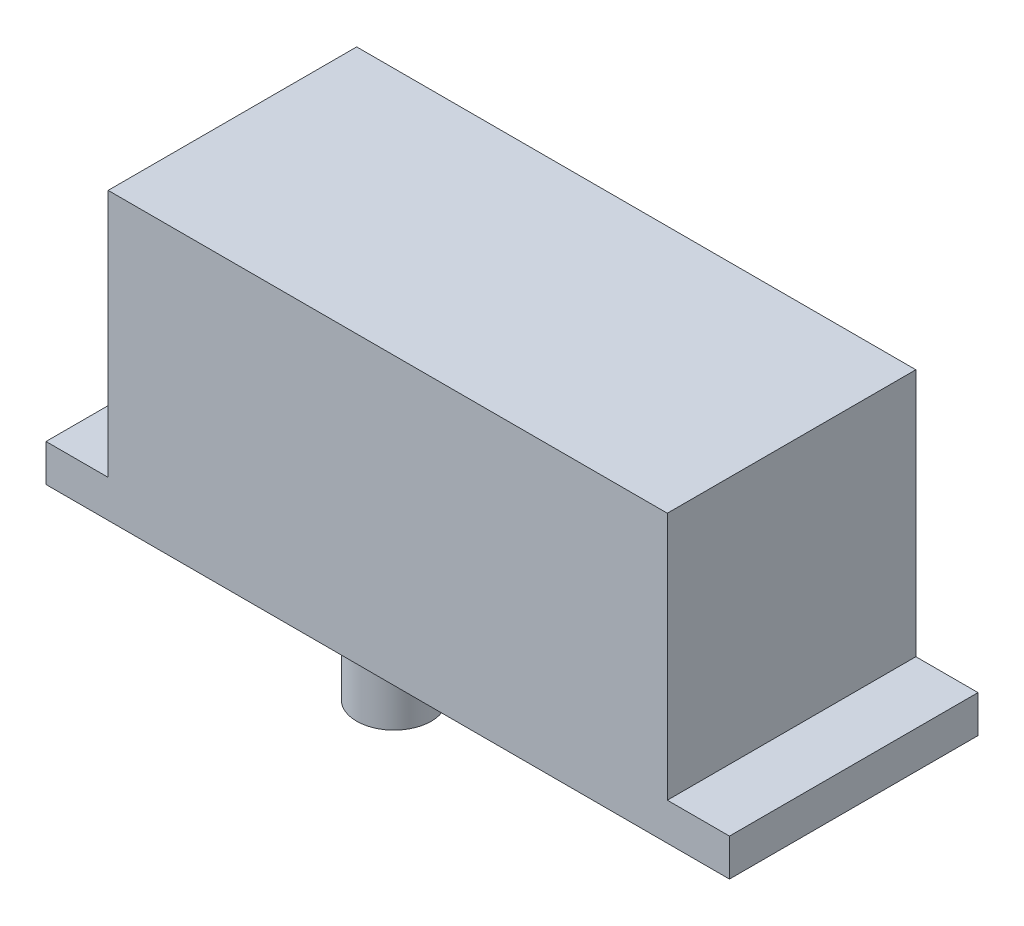
ISO-10303-21;
HEADER;
FILE_DESCRIPTION(('STEP AP214'),'2;1');
FILE_NAME('part.step','',(''),(''),'','','');
FILE_SCHEMA(('AUTOMOTIVE_DESIGN { 1 0 10303 214 1 1 1 1 }'));
ENDSEC;
DATA;
#1=APPLICATION_CONTEXT('core data for automotive mechanical design processes');
#2=APPLICATION_PROTOCOL_DEFINITION('international standard','automotive_design',2000,#1);
#3=PRODUCT_CONTEXT('',#1,'mechanical');
#4=PRODUCT('Part','Part','',(#3));
#5=PRODUCT_RELATED_PRODUCT_CATEGORY('part','',(#4));
#6=PRODUCT_DEFINITION_FORMATION('','',#4);
#7=PRODUCT_DEFINITION_CONTEXT('part definition',#1,'design');
#8=PRODUCT_DEFINITION('design','',#6,#7);
#9=PRODUCT_DEFINITION_SHAPE('','',#8);
#10=(LENGTH_UNIT() NAMED_UNIT(*) SI_UNIT(.MILLI.,.METRE.));
#11=(NAMED_UNIT(*) PLANE_ANGLE_UNIT() SI_UNIT($,.RADIAN.));
#12=(NAMED_UNIT(*) SI_UNIT($,.STERADIAN.) SOLID_ANGLE_UNIT());
#13=UNCERTAINTY_MEASURE_WITH_UNIT(LENGTH_MEASURE(1.E-05),#10,'distance_accuracy_value','');
#14=(GEOMETRIC_REPRESENTATION_CONTEXT(3) GLOBAL_UNCERTAINTY_ASSIGNED_CONTEXT((#13)) GLOBAL_UNIT_ASSIGNED_CONTEXT((#10,
#11,#12)) REPRESENTATION_CONTEXT('',''));
#15=CARTESIAN_POINT('',(0.,0.,0.));
#16=DIRECTION('',(0.,0.,1.));
#17=DIRECTION('',(1.,0.,0.));
#18=AXIS2_PLACEMENT_3D('',#15,#16,#17);
#19=CARTESIAN_POINT('',(-30.5,-13.,274.));
#20=DIRECTION('',(0.,1.,0.));
#21=DIRECTION('',(-1.,0.,0.));
#22=AXIS2_PLACEMENT_3D('',#19,#20,#21);
#23=PLANE('',#22);
#24=DIRECTION('',(1.,0.,0.));
#25=VECTOR('',#24,1.);
#26=CARTESIAN_POINT('',(-30.5,-13.,254.));
#27=LINE('',#26,#25);
#28=CARTESIAN_POINT('',(-30.5,-13.,254.));
#29=VERTEX_POINT('',#28);
#30=CARTESIAN_POINT('',(-25.5,-13.,254.));
#31=VERTEX_POINT('',#30);
#32=EDGE_CURVE('E156',#29,#31,#27,.T.);
#33=ORIENTED_EDGE('',*,*,#32,.T.);
#34=DIRECTION('',(0.,0.,-1.));
#35=VECTOR('',#34,1.);
#36=CARTESIAN_POINT('',(-25.5,-13.,274.));
#37=LINE('',#36,#35);
#38=CARTESIAN_POINT('',(-25.5,-13.,274.));
#39=VERTEX_POINT('',#38);
#40=EDGE_CURVE('E134',#39,#31,#37,.T.);
#41=ORIENTED_EDGE('',*,*,#40,.F.);
#42=DIRECTION('',(1.,0.,0.));
#43=VECTOR('',#42,1.);
#44=CARTESIAN_POINT('',(-30.5,-13.,274.));
#45=LINE('',#44,#43);
#46=CARTESIAN_POINT('',(-30.5,-13.,274.));
#47=VERTEX_POINT('',#46);
#48=EDGE_CURVE('E144',#47,#39,#45,.T.);
#49=ORIENTED_EDGE('',*,*,#48,.F.);
#50=DIRECTION('',(0.,0.,-1.));
#51=VECTOR('',#50,1.);
#52=CARTESIAN_POINT('',(-30.5,-13.,274.));
#53=LINE('',#52,#51);
#54=EDGE_CURVE('E197',#47,#29,#53,.T.);
#55=ORIENTED_EDGE('',*,*,#54,.T.);
#56=EDGE_LOOP('',(#33,#41,#49,#55));
#57=FACE_BOUND('',#56,.T.);
#58=ADVANCED_FACE('F41',(#57),#23,.F.);
#59=CARTESIAN_POINT('',(-25.5,-13.,274.));
#60=DIRECTION('',(0.707106781186548,0.707106781186547,0.));
#61=DIRECTION('',(-0.707106781186547,0.707106781186548,0.));
#62=AXIS2_PLACEMENT_3D('',#59,#60,#61);
#63=PLANE('',#62);
#64=ORIENTED_EDGE('',*,*,#40,.T.);
#65=DIRECTION('',(0.577350269189625,-0.577350269189626,0.577350269189626));
#66=VECTOR('',#65,1.);
#67=CARTESIAN_POINT('',(-20.5,-18.,259.));
#68=LINE('',#67,#66);
#69=CARTESIAN_POINT('',(-20.5,-18.,259.));
#70=VERTEX_POINT('',#69);
#71=EDGE_CURVE('E56',#31,#70,#68,.T.);
#72=ORIENTED_EDGE('',*,*,#71,.T.);
#73=DIRECTION('',(0.,0.,-1.));
#74=VECTOR('',#73,1.);
#75=CARTESIAN_POINT('',(-20.5,-18.,274.));
#76=LINE('',#75,#74);
#77=CARTESIAN_POINT('',(-20.5,-18.,269.));
#78=VERTEX_POINT('',#77);
#79=EDGE_CURVE('E136',#78,#70,#76,.T.);
#80=ORIENTED_EDGE('',*,*,#79,.F.);
#81=DIRECTION('',(0.577350269189625,-0.577350269189626,-0.577350269189626));
#82=VECTOR('',#81,1.);
#83=CARTESIAN_POINT('',(-17.,-21.5,265.5));
#84=LINE('',#83,#82);
#85=EDGE_CURVE('E130',#78,#39,#84,.F.);
#86=ORIENTED_EDGE('',*,*,#85,.T.);
#87=EDGE_LOOP('',(#64,#72,#80,#86));
#88=FACE_BOUND('',#87,.T.);
#89=ADVANCED_FACE('F132',(#88),#63,.F.);
#90=CARTESIAN_POINT('',(-20.5,-18.,274.));
#91=DIRECTION('',(0.,1.,0.));
#92=DIRECTION('',(0.,0.,1.));
#93=AXIS2_PLACEMENT_3D('',#90,#91,#92);
#94=PLANE('',#93);
#95=CARTESIAN_POINT('',(-12.5,-18.,264.));
#96=DIRECTION('',(0.,1.,0.));
#97=DIRECTION('',(0.,0.,1.));
#98=AXIS2_PLACEMENT_3D('',#95,#96,#97);
#99=CIRCLE('',#98,3.);
#100=CARTESIAN_POINT('',(-12.5,-18.,267.));
#101=VERTEX_POINT('',#100);
#102=EDGE_CURVE('E11',#101,#101,#99,.F.);
#103=ORIENTED_EDGE('',*,*,#102,.F.);
#104=EDGE_LOOP('',(#103));
#105=FACE_BOUND('',#104,.T.);
#106=ORIENTED_EDGE('',*,*,#79,.T.);
#107=DIRECTION('',(1.,0.,0.));
#108=VECTOR('',#107,1.);
#109=CARTESIAN_POINT('',(14.5,-18.,259.));
#110=LINE('',#109,#108);
#111=CARTESIAN_POINT('',(14.5,-18.,259.));
#112=VERTEX_POINT('',#111);
#113=EDGE_CURVE('E165',#70,#112,#110,.T.);
#114=ORIENTED_EDGE('',*,*,#113,.T.);
#115=DIRECTION('',(0.,0.,-1.));
#116=VECTOR('',#115,1.);
#117=CARTESIAN_POINT('',(14.5,-18.,274.));
#118=LINE('',#117,#116);
#119=CARTESIAN_POINT('',(14.5,-18.,269.));
#120=VERTEX_POINT('',#119);
#121=EDGE_CURVE('E170',#120,#112,#118,.T.);
#122=ORIENTED_EDGE('',*,*,#121,.F.);
#123=DIRECTION('',(-1.,0.,0.));
#124=VECTOR('',#123,1.);
#125=CARTESIAN_POINT('',(-20.5,-18.,269.));
#126=LINE('',#125,#124);
#127=EDGE_CURVE('E63',#120,#78,#126,.T.);
#128=ORIENTED_EDGE('',*,*,#127,.T.);
#129=EDGE_LOOP('',(#106,#114,#122,#128));
#130=FACE_BOUND('',#129,.T.);
#131=ADVANCED_FACE('F241',(#105,#130),#94,.F.);
#132=CARTESIAN_POINT('',(19.5,-13.,274.));
#133=DIRECTION('',(-0.707106781186548,0.707106781186547,0.));
#134=DIRECTION('',(-0.707106781186547,-0.707106781186548,0.));
#135=AXIS2_PLACEMENT_3D('',#132,#133,#134);
#136=PLANE('',#135);
#137=ORIENTED_EDGE('',*,*,#121,.T.);
#138=DIRECTION('',(0.577350269189625,0.577350269189626,-0.577350269189626));
#139=VECTOR('',#138,1.);
#140=CARTESIAN_POINT('',(2.83333333333339,-29.6666666666667,270.666666666667));
#141=LINE('',#140,#139);
#142=CARTESIAN_POINT('',(19.5,-13.,254.));
#143=VERTEX_POINT('',#142);
#144=EDGE_CURVE('E162',#112,#143,#141,.T.);
#145=ORIENTED_EDGE('',*,*,#144,.T.);
#146=DIRECTION('',(0.,0.,-1.));
#147=VECTOR('',#146,1.);
#148=CARTESIAN_POINT('',(19.5,-13.,274.));
#149=LINE('',#148,#147);
#150=CARTESIAN_POINT('',(19.5,-13.,274.));
#151=VERTEX_POINT('',#150);
#152=EDGE_CURVE('E173',#151,#143,#149,.T.);
#153=ORIENTED_EDGE('',*,*,#152,.F.);
#154=DIRECTION('',(0.577350269189625,0.577350269189626,0.577350269189626));
#155=VECTOR('',#154,1.);
#156=CARTESIAN_POINT('',(13.,-19.5,267.5));
#157=LINE('',#156,#155);
#158=EDGE_CURVE('E158',#151,#120,#157,.F.);
#159=ORIENTED_EDGE('',*,*,#158,.T.);
#160=EDGE_LOOP('',(#137,#145,#153,#159));
#161=FACE_BOUND('',#160,.T.);
#162=ADVANCED_FACE('F243',(#161),#136,.F.);
#163=CARTESIAN_POINT('',(24.5,-13.,274.));
#164=DIRECTION('',(0.,1.,0.));
#165=DIRECTION('',(0.,0.,1.));
#166=AXIS2_PLACEMENT_3D('',#163,#164,#165);
#167=PLANE('',#166);
#168=DIRECTION('',(1.,0.,0.));
#169=VECTOR('',#168,1.);
#170=CARTESIAN_POINT('',(24.5,-13.,254.));
#171=LINE('',#170,#169);
#172=CARTESIAN_POINT('',(24.5,-13.,254.));
#173=VERTEX_POINT('',#172);
#174=EDGE_CURVE('E212',#143,#173,#171,.T.);
#175=ORIENTED_EDGE('',*,*,#174,.T.);
#176=DIRECTION('',(0.,0.,-1.));
#177=VECTOR('',#176,1.);
#178=CARTESIAN_POINT('',(24.5,-13.,274.));
#179=LINE('',#178,#177);
#180=CARTESIAN_POINT('',(24.5,-13.,274.));
#181=VERTEX_POINT('',#180);
#182=EDGE_CURVE('E176',#181,#173,#179,.T.);
#183=ORIENTED_EDGE('',*,*,#182,.F.);
#184=DIRECTION('',(1.,0.,0.));
#185=VECTOR('',#184,1.);
#186=CARTESIAN_POINT('',(24.5,-13.,274.));
#187=LINE('',#186,#185);
#188=EDGE_CURVE('E152',#151,#181,#187,.T.);
#189=ORIENTED_EDGE('',*,*,#188,.F.);
#190=ORIENTED_EDGE('',*,*,#152,.T.);
#191=EDGE_LOOP('',(#175,#183,#189,#190));
#192=FACE_BOUND('',#191,.T.);
#193=ADVANCED_FACE('F253',(#192),#167,.F.);
#194=CARTESIAN_POINT('',(24.5,-10.,274.));
#195=DIRECTION('',(-1.,0.,0.));
#196=DIRECTION('',(0.,0.,1.));
#197=AXIS2_PLACEMENT_3D('',#194,#195,#196);
#198=PLANE('',#197);
#199=DIRECTION('',(0.,1.,0.));
#200=VECTOR('',#199,1.);
#201=CARTESIAN_POINT('',(24.5,-10.,254.));
#202=LINE('',#201,#200);
#203=CARTESIAN_POINT('',(24.5,-10.,254.));
#204=VERTEX_POINT('',#203);
#205=EDGE_CURVE('E210',#173,#204,#202,.T.);
#206=ORIENTED_EDGE('',*,*,#205,.T.);
#207=DIRECTION('',(0.,0.,-1.));
#208=VECTOR('',#207,1.);
#209=CARTESIAN_POINT('',(24.5,-10.,274.));
#210=LINE('',#209,#208);
#211=CARTESIAN_POINT('',(24.5,-10.,274.));
#212=VERTEX_POINT('',#211);
#213=EDGE_CURVE('E179',#212,#204,#210,.T.);
#214=ORIENTED_EDGE('',*,*,#213,.F.);
#215=DIRECTION('',(0.,1.,0.));
#216=VECTOR('',#215,1.);
#217=CARTESIAN_POINT('',(24.5,-10.,274.));
#218=LINE('',#217,#216);
#219=EDGE_CURVE('E227',#181,#212,#218,.T.);
#220=ORIENTED_EDGE('',*,*,#219,.F.);
#221=ORIENTED_EDGE('',*,*,#182,.T.);
#222=EDGE_LOOP('',(#206,#214,#220,#221));
#223=FACE_BOUND('',#222,.T.);
#224=ADVANCED_FACE('F262',(#223),#198,.F.);
#225=CARTESIAN_POINT('',(19.5,-10.,274.));
#226=DIRECTION('',(0.,-1.,0.));
#227=DIRECTION('',(0.,0.,-1.));
#228=AXIS2_PLACEMENT_3D('',#225,#226,#227);
#229=PLANE('',#228);
#230=DIRECTION('',(-1.,0.,0.));
#231=VECTOR('',#230,1.);
#232=CARTESIAN_POINT('',(19.5,-10.,254.));
#233=LINE('',#232,#231);
#234=CARTESIAN_POINT('',(19.5,-10.,254.));
#235=VERTEX_POINT('',#234);
#236=EDGE_CURVE('E208',#204,#235,#233,.T.);
#237=ORIENTED_EDGE('',*,*,#236,.T.);
#238=DIRECTION('',(0.,0.,-1.));
#239=VECTOR('',#238,1.);
#240=CARTESIAN_POINT('',(19.5,-10.,274.));
#241=LINE('',#240,#239);
#242=CARTESIAN_POINT('',(19.5,-10.,274.));
#243=VERTEX_POINT('',#242);
#244=EDGE_CURVE('E182',#243,#235,#241,.T.);
#245=ORIENTED_EDGE('',*,*,#244,.F.);
#246=DIRECTION('',(-1.,0.,0.));
#247=VECTOR('',#246,1.);
#248=CARTESIAN_POINT('',(19.5,-10.,274.));
#249=LINE('',#248,#247);
#250=EDGE_CURVE('E225',#212,#243,#249,.T.);
#251=ORIENTED_EDGE('',*,*,#250,.F.);
#252=ORIENTED_EDGE('',*,*,#213,.T.);
#253=EDGE_LOOP('',(#237,#245,#251,#252));
#254=FACE_BOUND('',#253,.T.);
#255=ADVANCED_FACE('F266',(#254),#229,.F.);
#256=CARTESIAN_POINT('',(19.5,9.99999999999999,274.));
#257=DIRECTION('',(-1.,0.,0.));
#258=DIRECTION('',(0.,-1.,0.));
#259=AXIS2_PLACEMENT_3D('',#256,#257,#258);
#260=PLANE('',#259);
#261=DIRECTION('',(0.,1.,0.));
#262=VECTOR('',#261,1.);
#263=CARTESIAN_POINT('',(19.5,9.99999999999999,254.));
#264=LINE('',#263,#262);
#265=CARTESIAN_POINT('',(19.5,9.99999999999999,254.));
#266=VERTEX_POINT('',#265);
#267=EDGE_CURVE('E206',#235,#266,#264,.T.);
#268=ORIENTED_EDGE('',*,*,#267,.T.);
#269=DIRECTION('',(0.,0.,-1.));
#270=VECTOR('',#269,1.);
#271=CARTESIAN_POINT('',(19.5,9.99999999999999,274.));
#272=LINE('',#271,#270);
#273=CARTESIAN_POINT('',(19.5,9.99999999999999,274.));
#274=VERTEX_POINT('',#273);
#275=EDGE_CURVE('E185',#274,#266,#272,.T.);
#276=ORIENTED_EDGE('',*,*,#275,.F.);
#277=DIRECTION('',(0.,1.,0.));
#278=VECTOR('',#277,1.);
#279=CARTESIAN_POINT('',(19.5,9.99999999999999,274.));
#280=LINE('',#279,#278);
#281=EDGE_CURVE('E223',#243,#274,#280,.T.);
#282=ORIENTED_EDGE('',*,*,#281,.F.);
#283=ORIENTED_EDGE('',*,*,#244,.T.);
#284=EDGE_LOOP('',(#268,#276,#282,#283));
#285=FACE_BOUND('',#284,.T.);
#286=ADVANCED_FACE('F273',(#285),#260,.F.);
#287=CARTESIAN_POINT('',(-25.5,9.99999999999999,274.));
#288=DIRECTION('',(0.,-1.,0.));
#289=DIRECTION('',(1.,0.,0.));
#290=AXIS2_PLACEMENT_3D('',#287,#288,#289);
#291=PLANE('',#290);
#292=DIRECTION('',(-1.,0.,0.));
#293=VECTOR('',#292,1.);
#294=CARTESIAN_POINT('',(-25.5,9.99999999999999,254.));
#295=LINE('',#294,#293);
#296=CARTESIAN_POINT('',(-25.5,9.99999999999999,254.));
#297=VERTEX_POINT('',#296);
#298=EDGE_CURVE('E204',#266,#297,#295,.T.);
#299=ORIENTED_EDGE('',*,*,#298,.T.);
#300=DIRECTION('',(0.,0.,-1.));
#301=VECTOR('',#300,1.);
#302=CARTESIAN_POINT('',(-25.5,9.99999999999999,274.));
#303=LINE('',#302,#301);
#304=CARTESIAN_POINT('',(-25.5,9.99999999999999,274.));
#305=VERTEX_POINT('',#304);
#306=EDGE_CURVE('E188',#305,#297,#303,.T.);
#307=ORIENTED_EDGE('',*,*,#306,.F.);
#308=DIRECTION('',(-1.,0.,0.));
#309=VECTOR('',#308,1.);
#310=CARTESIAN_POINT('',(-25.5,9.99999999999999,274.));
#311=LINE('',#310,#309);
#312=EDGE_CURVE('E221',#274,#305,#311,.T.);
#313=ORIENTED_EDGE('',*,*,#312,.F.);
#314=ORIENTED_EDGE('',*,*,#275,.T.);
#315=EDGE_LOOP('',(#299,#307,#313,#314));
#316=FACE_BOUND('',#315,.T.);
#317=ADVANCED_FACE('F276',(#316),#291,.F.);
#318=CARTESIAN_POINT('',(-25.5,9.99999999999999,274.));
#319=DIRECTION('',(1.,0.,0.));
#320=DIRECTION('',(0.,0.,-1.));
#321=AXIS2_PLACEMENT_3D('',#318,#319,#320);
#322=PLANE('',#321);
#323=DIRECTION('',(0.,-1.,0.));
#324=VECTOR('',#323,1.);
#325=CARTESIAN_POINT('',(-25.5,9.99999999999999,254.));
#326=LINE('',#325,#324);
#327=CARTESIAN_POINT('',(-25.5,-10.,254.));
#328=VERTEX_POINT('',#327);
#329=EDGE_CURVE('E202',#297,#328,#326,.T.);
#330=ORIENTED_EDGE('',*,*,#329,.T.);
#331=DIRECTION('',(0.,0.,-1.));
#332=VECTOR('',#331,1.);
#333=CARTESIAN_POINT('',(-25.5,-10.,274.));
#334=LINE('',#333,#332);
#335=CARTESIAN_POINT('',(-25.5,-10.,274.));
#336=VERTEX_POINT('',#335);
#337=EDGE_CURVE('E191',#336,#328,#334,.T.);
#338=ORIENTED_EDGE('',*,*,#337,.F.);
#339=DIRECTION('',(0.,-1.,0.));
#340=VECTOR('',#339,1.);
#341=CARTESIAN_POINT('',(-25.5,9.99999999999999,274.));
#342=LINE('',#341,#340);
#343=EDGE_CURVE('E219',#305,#336,#342,.T.);
#344=ORIENTED_EDGE('',*,*,#343,.F.);
#345=ORIENTED_EDGE('',*,*,#306,.T.);
#346=EDGE_LOOP('',(#330,#338,#344,#345));
#347=FACE_BOUND('',#346,.T.);
#348=ADVANCED_FACE('F281',(#347),#322,.F.);
#349=CARTESIAN_POINT('',(-25.5,-10.,274.));
#350=DIRECTION('',(0.,-1.,0.));
#351=DIRECTION('',(1.,0.,0.));
#352=AXIS2_PLACEMENT_3D('',#349,#350,#351);
#353=PLANE('',#352);
#354=DIRECTION('',(-1.,0.,0.));
#355=VECTOR('',#354,1.);
#356=CARTESIAN_POINT('',(-25.5,-10.,254.));
#357=LINE('',#356,#355);
#358=CARTESIAN_POINT('',(-30.5,-10.,254.));
#359=VERTEX_POINT('',#358);
#360=EDGE_CURVE('E200',#328,#359,#357,.T.);
#361=ORIENTED_EDGE('',*,*,#360,.T.);
#362=DIRECTION('',(0.,0.,-1.));
#363=VECTOR('',#362,1.);
#364=CARTESIAN_POINT('',(-30.5,-10.,274.));
#365=LINE('',#364,#363);
#366=CARTESIAN_POINT('',(-30.5,-10.,274.));
#367=VERTEX_POINT('',#366);
#368=EDGE_CURVE('E194',#367,#359,#365,.T.);
#369=ORIENTED_EDGE('',*,*,#368,.F.);
#370=DIRECTION('',(-1.,0.,0.));
#371=VECTOR('',#370,1.);
#372=CARTESIAN_POINT('',(-25.5,-10.,274.));
#373=LINE('',#372,#371);
#374=EDGE_CURVE('E217',#336,#367,#373,.T.);
#375=ORIENTED_EDGE('',*,*,#374,.F.);
#376=ORIENTED_EDGE('',*,*,#337,.T.);
#377=EDGE_LOOP('',(#361,#369,#375,#376));
#378=FACE_BOUND('',#377,.T.);
#379=ADVANCED_FACE('F285',(#378),#353,.F.);
#380=CARTESIAN_POINT('',(-30.5,-10.,274.));
#381=DIRECTION('',(1.,0.,0.));
#382=DIRECTION('',(0.,0.,-1.));
#383=AXIS2_PLACEMENT_3D('',#380,#381,#382);
#384=PLANE('',#383);
#385=DIRECTION('',(0.,-1.,0.));
#386=VECTOR('',#385,1.);
#387=CARTESIAN_POINT('',(-30.5,-10.,254.));
#388=LINE('',#387,#386);
#389=EDGE_CURVE('E153',#359,#29,#388,.T.);
#390=ORIENTED_EDGE('',*,*,#389,.T.);
#391=ORIENTED_EDGE('',*,*,#54,.F.);
#392=DIRECTION('',(0.,-1.,0.));
#393=VECTOR('',#392,1.);
#394=CARTESIAN_POINT('',(-30.5,-10.,274.));
#395=LINE('',#394,#393);
#396=EDGE_CURVE('E148',#367,#47,#395,.T.);
#397=ORIENTED_EDGE('',*,*,#396,.F.);
#398=ORIENTED_EDGE('',*,*,#368,.T.);
#399=EDGE_LOOP('',(#390,#391,#397,#398));
#400=FACE_BOUND('',#399,.T.);
#401=ADVANCED_FACE('F289',(#400),#384,.F.);
#402=CARTESIAN_POINT('',(0.,0.,274.));
#403=DIRECTION('',(0.,0.,-1.));
#404=DIRECTION('',(-1.,0.,0.));
#405=AXIS2_PLACEMENT_3D('',#402,#403,#404);
#406=PLANE('',#405);
#407=ORIENTED_EDGE('',*,*,#48,.T.);
#408=DIRECTION('',(1.,0.,0.));
#409=VECTOR('',#408,1.);
#410=CARTESIAN_POINT('',(0.,-13.,274.));
#411=LINE('',#410,#409);
#412=EDGE_CURVE('E49',#39,#151,#411,.T.);
#413=ORIENTED_EDGE('',*,*,#412,.T.);
#414=ORIENTED_EDGE('',*,*,#188,.T.);
#415=ORIENTED_EDGE('',*,*,#219,.T.);
#416=ORIENTED_EDGE('',*,*,#250,.T.);
#417=ORIENTED_EDGE('',*,*,#281,.T.);
#418=ORIENTED_EDGE('',*,*,#312,.T.);
#419=ORIENTED_EDGE('',*,*,#343,.T.);
#420=ORIENTED_EDGE('',*,*,#374,.T.);
#421=ORIENTED_EDGE('',*,*,#396,.T.);
#422=EDGE_LOOP('',(#407,#413,#414,#415,#416,#417,#418,#419,#420,#421));
#423=FACE_BOUND('',#422,.T.);
#424=ADVANCED_FACE('F145',(#423),#406,.F.);
#425=CARTESIAN_POINT('',(0.,0.,254.));
#426=DIRECTION('',(0.,0.,-1.));
#427=DIRECTION('',(-1.,0.,0.));
#428=AXIS2_PLACEMENT_3D('',#425,#426,#427);
#429=PLANE('',#428);
#430=ORIENTED_EDGE('',*,*,#174,.F.);
#431=DIRECTION('',(-1.,0.,0.));
#432=VECTOR('',#431,1.);
#433=CARTESIAN_POINT('',(-20.5,-13.,254.));
#434=LINE('',#433,#432);
#435=EDGE_CURVE('E139',#143,#31,#434,.T.);
#436=ORIENTED_EDGE('',*,*,#435,.T.);
#437=ORIENTED_EDGE('',*,*,#32,.F.);
#438=ORIENTED_EDGE('',*,*,#389,.F.);
#439=ORIENTED_EDGE('',*,*,#360,.F.);
#440=ORIENTED_EDGE('',*,*,#329,.F.);
#441=ORIENTED_EDGE('',*,*,#298,.F.);
#442=ORIENTED_EDGE('',*,*,#267,.F.);
#443=ORIENTED_EDGE('',*,*,#236,.F.);
#444=ORIENTED_EDGE('',*,*,#205,.F.);
#445=EDGE_LOOP('',(#430,#436,#437,#438,#439,#440,#441,#442,#443,#444));
#446=FACE_BOUND('',#445,.T.);
#447=ADVANCED_FACE('F257',(#446),#429,.T.);
#448=CARTESIAN_POINT('',(-20.5,-18.,259.));
#449=DIRECTION('',(0.,-0.707106781186547,-0.707106781186548));
#450=DIRECTION('',(-1.,0.,0.));
#451=AXIS2_PLACEMENT_3D('',#448,#449,#450);
#452=PLANE('',#451);
#453=ORIENTED_EDGE('',*,*,#71,.F.);
#454=ORIENTED_EDGE('',*,*,#435,.F.);
#455=ORIENTED_EDGE('',*,*,#144,.F.);
#456=ORIENTED_EDGE('',*,*,#113,.F.);
#457=EDGE_LOOP('',(#453,#454,#455,#456));
#458=FACE_BOUND('',#457,.T.);
#459=ADVANCED_FACE('F247',(#458),#452,.T.);
#460=CARTESIAN_POINT('',(0.,-13.,274.));
#461=DIRECTION('',(0.,0.707106781186547,-0.707106781186548));
#462=DIRECTION('',(1.,0.,0.));
#463=AXIS2_PLACEMENT_3D('',#460,#461,#462);
#464=PLANE('',#463);
#465=ORIENTED_EDGE('',*,*,#85,.F.);
#466=ORIENTED_EDGE('',*,*,#127,.F.);
#467=ORIENTED_EDGE('',*,*,#158,.F.);
#468=ORIENTED_EDGE('',*,*,#412,.F.);
#469=EDGE_LOOP('',(#465,#466,#467,#468));
#470=FACE_BOUND('',#469,.T.);
#471=ADVANCED_FACE('F43',(#470),#464,.F.);
#472=CARTESIAN_POINT('',(-12.5,-24.,264.));
#473=DIRECTION('',(0.,1.,0.));
#474=DIRECTION('',(-1.,0.,0.));
#475=AXIS2_PLACEMENT_3D('',#472,#473,#474);
#476=CYLINDRICAL_SURFACE('',#475,3.);
#477=CARTESIAN_POINT('',(-12.5,-24.,264.));
#478=DIRECTION('',(0.,-1.,0.));
#479=DIRECTION('',(1.,0.,0.));
#480=AXIS2_PLACEMENT_3D('',#477,#478,#479);
#481=CIRCLE('',#480,3.);
#482=CARTESIAN_POINT('',(-9.5,-24.,264.));
#483=VERTEX_POINT('',#482);
#484=EDGE_CURVE('E215',#483,#483,#481,.T.);
#485=ORIENTED_EDGE('',*,*,#484,.F.);
#486=EDGE_LOOP('',(#485));
#487=FACE_BOUND('',#486,.T.);
#488=ORIENTED_EDGE('',*,*,#102,.T.);
#489=EDGE_LOOP('',(#488));
#490=FACE_BOUND('',#489,.T.);
#491=ADVANCED_FACE('F235',(#487,#490),#476,.T.);
#492=CARTESIAN_POINT('',(-12.5,-24.,264.));
#493=DIRECTION('',(0.,-1.,0.));
#494=DIRECTION('',(1.,0.,0.));
#495=AXIS2_PLACEMENT_3D('',#492,#493,#494);
#496=PLANE('',#495);
#497=ORIENTED_EDGE('',*,*,#484,.T.);
#498=EDGE_LOOP('',(#497));
#499=FACE_BOUND('',#498,.T.);
#500=ADVANCED_FACE('F233',(#499),#496,.T.);
#501=CLOSED_SHELL('',(#58,#89,#131,#162,#193,#224,#255,#286,#317,#348,#379,#401,#424,#447,#459,
#471,#491,#500));
#502=MANIFOLD_SOLID_BREP('B2',#501);
#503=ADVANCED_BREP_SHAPE_REPRESENTATION('',(#18,#502),#14);
#504=SHAPE_DEFINITION_REPRESENTATION(#9,#503);
ENDSEC;
END-ISO-10303-21;
